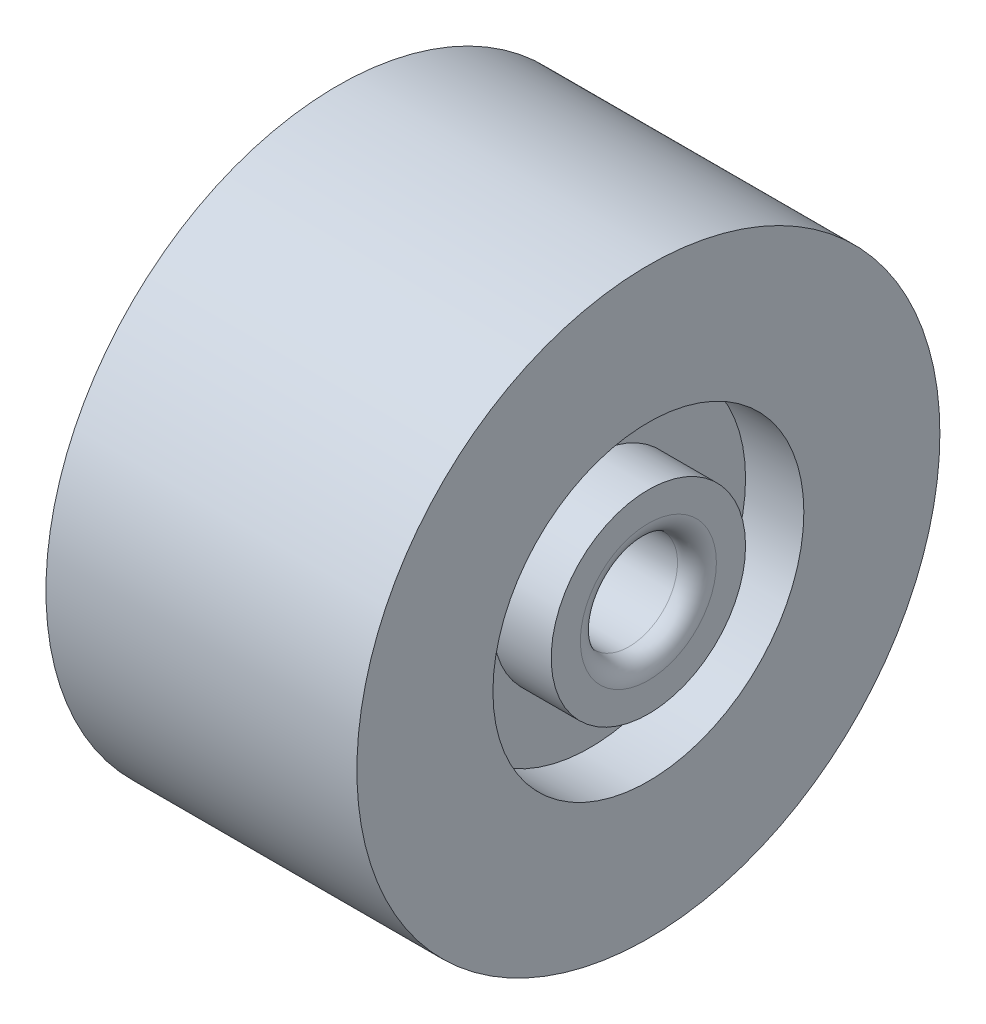
ISO-10303-21;
HEADER;
FILE_DESCRIPTION(('STEP AP214'),'2;1');
FILE_NAME('part.step','',(''),(''),'','','');
FILE_SCHEMA(('AUTOMOTIVE_DESIGN { 1 0 10303 214 1 1 1 1 }'));
ENDSEC;
DATA;
#1=APPLICATION_CONTEXT('core data for automotive mechanical design processes');
#2=APPLICATION_PROTOCOL_DEFINITION('international standard','automotive_design',2000,#1);
#3=PRODUCT_CONTEXT('',#1,'mechanical');
#4=PRODUCT('Part','Part','',(#3));
#5=PRODUCT_RELATED_PRODUCT_CATEGORY('part','',(#4));
#6=PRODUCT_DEFINITION_FORMATION('','',#4);
#7=PRODUCT_DEFINITION_CONTEXT('part definition',#1,'design');
#8=PRODUCT_DEFINITION('design','',#6,#7);
#9=PRODUCT_DEFINITION_SHAPE('','',#8);
#10=(LENGTH_UNIT() NAMED_UNIT(*) SI_UNIT(.MILLI.,.METRE.));
#11=(NAMED_UNIT(*) PLANE_ANGLE_UNIT() SI_UNIT($,.RADIAN.));
#12=(NAMED_UNIT(*) SI_UNIT($,.STERADIAN.) SOLID_ANGLE_UNIT());
#13=UNCERTAINTY_MEASURE_WITH_UNIT(LENGTH_MEASURE(1.E-05),#10,'distance_accuracy_value','');
#14=(GEOMETRIC_REPRESENTATION_CONTEXT(3) GLOBAL_UNCERTAINTY_ASSIGNED_CONTEXT((#13)) GLOBAL_UNIT_ASSIGNED_CONTEXT((#10,
#11,#12)) REPRESENTATION_CONTEXT('',''));
#15=CARTESIAN_POINT('',(0.,0.,0.));
#16=DIRECTION('',(0.,0.,1.));
#17=DIRECTION('',(1.,0.,0.));
#18=AXIS2_PLACEMENT_3D('',#15,#16,#17);
#19=CARTESIAN_POINT('',(0.,-2.50000000000001,0.));
#20=DIRECTION('',(1.,0.,0.));
#21=DIRECTION('',(0.,0.,-1.));
#22=AXIS2_PLACEMENT_3D('',#19,#20,#21);
#23=PLANE('',#22);
#24=CARTESIAN_POINT('',(0.,-2.50000000000001,0.));
#25=DIRECTION('',(1.,0.,0.));
#26=DIRECTION('',(0.,0.,-1.));
#27=AXIS2_PLACEMENT_3D('',#24,#25,#26);
#28=CIRCLE('',#27,3.5);
#29=CARTESIAN_POINT('',(0.,-2.50000000000001,-3.5));
#30=VERTEX_POINT('',#29);
#31=EDGE_CURVE('E10',#30,#30,#28,.F.);
#32=ORIENTED_EDGE('',*,*,#31,.T.);
#33=EDGE_LOOP('',(#32));
#34=FACE_BOUND('',#33,.T.);
#35=CARTESIAN_POINT('',(0.,-2.50000000000001,0.));
#36=DIRECTION('',(1.,0.,0.));
#37=DIRECTION('',(0.,0.,-1.));
#38=AXIS2_PLACEMENT_3D('',#35,#36,#37);
#39=CIRCLE('',#38,5.00000000000001);
#40=CARTESIAN_POINT('',(0.,-2.50000000000001,-5.00000000000001));
#41=VERTEX_POINT('',#40);
#42=EDGE_CURVE('E53',#41,#41,#39,.T.);
#43=ORIENTED_EDGE('',*,*,#42,.T.);
#44=EDGE_LOOP('',(#43));
#45=FACE_BOUND('',#44,.T.);
#46=ADVANCED_FACE('F33',(#34,#45),#23,.T.);
#47=CARTESIAN_POINT('',(8.18725966843203,-2.50000000000001,0.));
#48=DIRECTION('',(1.,0.,0.));
#49=DIRECTION('',(0.,0.,-1.));
#50=AXIS2_PLACEMENT_3D('',#47,#48,#49);
#51=CYLINDRICAL_SURFACE('',#50,5.00000000000001);
#52=CARTESIAN_POINT('',(-3.,-2.50000000000001,0.));
#53=DIRECTION('',(1.,0.,0.));
#54=DIRECTION('',(0.,0.,-1.));
#55=AXIS2_PLACEMENT_3D('',#52,#53,#54);
#56=CIRCLE('',#55,5.00000000000001);
#57=CARTESIAN_POINT('',(-3.,-2.50000000000001,-5.00000000000001));
#58=VERTEX_POINT('',#57);
#59=EDGE_CURVE('E56',#58,#58,#56,.T.);
#60=ORIENTED_EDGE('',*,*,#59,.T.);
#61=EDGE_LOOP('',(#60));
#62=FACE_BOUND('',#61,.T.);
#63=ORIENTED_EDGE('',*,*,#42,.F.);
#64=EDGE_LOOP('',(#63));
#65=FACE_BOUND('',#64,.T.);
#66=ADVANCED_FACE('F101',(#62,#65),#51,.T.);
#67=CARTESIAN_POINT('',(-3.,2.5,0.));
#68=DIRECTION('',(1.,0.,0.));
#69=DIRECTION('',(0.,0.,-1.));
#70=AXIS2_PLACEMENT_3D('',#67,#68,#69);
#71=PLANE('',#70);
#72=CARTESIAN_POINT('',(-3.,-2.50000000000001,0.));
#73=DIRECTION('',(1.,0.,0.));
#74=DIRECTION('',(0.,0.,-1.));
#75=AXIS2_PLACEMENT_3D('',#72,#73,#74);
#76=CIRCLE('',#75,8.00000000000001);
#77=CARTESIAN_POINT('',(-3.,-2.50000000000001,-8.00000000000001));
#78=VERTEX_POINT('',#77);
#79=EDGE_CURVE('E59',#78,#78,#76,.T.);
#80=ORIENTED_EDGE('',*,*,#79,.T.);
#81=EDGE_LOOP('',(#80));
#82=FACE_BOUND('',#81,.T.);
#83=ORIENTED_EDGE('',*,*,#59,.F.);
#84=EDGE_LOOP('',(#83));
#85=FACE_BOUND('',#84,.T.);
#86=ADVANCED_FACE('F106',(#82,#85),#71,.T.);
#87=CARTESIAN_POINT('',(8.18725966843203,-2.50000000000001,0.));
#88=DIRECTION('',(1.,0.,0.));
#89=DIRECTION('',(0.,0.,-1.));
#90=AXIS2_PLACEMENT_3D('',#87,#88,#89);
#91=CYLINDRICAL_SURFACE('',#90,8.00000000000001);
#92=CARTESIAN_POINT('',(0.,-2.50000000000001,0.));
#93=DIRECTION('',(1.,0.,0.));
#94=DIRECTION('',(0.,0.,-1.));
#95=AXIS2_PLACEMENT_3D('',#92,#93,#94);
#96=CIRCLE('',#95,8.00000000000001);
#97=CARTESIAN_POINT('',(0.,-2.50000000000001,-8.00000000000001));
#98=VERTEX_POINT('',#97);
#99=EDGE_CURVE('E62',#98,#98,#96,.T.);
#100=ORIENTED_EDGE('',*,*,#99,.T.);
#101=EDGE_LOOP('',(#100));
#102=FACE_BOUND('',#101,.T.);
#103=ORIENTED_EDGE('',*,*,#79,.F.);
#104=EDGE_LOOP('',(#103));
#105=FACE_BOUND('',#104,.T.);
#106=ADVANCED_FACE('F198',(#102,#105),#91,.F.);
#107=CARTESIAN_POINT('',(0.,5.5,0.));
#108=DIRECTION('',(1.,0.,0.));
#109=DIRECTION('',(0.,0.,-1.));
#110=AXIS2_PLACEMENT_3D('',#107,#108,#109);
#111=PLANE('',#110);
#112=CARTESIAN_POINT('',(0.,-2.50000000000001,0.));
#113=DIRECTION('',(1.,0.,0.));
#114=DIRECTION('',(0.,0.,-1.));
#115=AXIS2_PLACEMENT_3D('',#112,#113,#114);
#116=CIRCLE('',#115,15.);
#117=CARTESIAN_POINT('',(0.,-2.50000000000001,-15.));
#118=VERTEX_POINT('',#117);
#119=EDGE_CURVE('E65',#118,#118,#116,.T.);
#120=ORIENTED_EDGE('',*,*,#119,.T.);
#121=EDGE_LOOP('',(#120));
#122=FACE_BOUND('',#121,.T.);
#123=ORIENTED_EDGE('',*,*,#99,.F.);
#124=EDGE_LOOP('',(#123));
#125=FACE_BOUND('',#124,.T.);
#126=ADVANCED_FACE('F188',(#122,#125),#111,.T.);
#127=CARTESIAN_POINT('',(8.18725966843203,-2.50000000000001,0.));
#128=DIRECTION('',(1.,0.,0.));
#129=DIRECTION('',(0.,0.,-1.));
#130=AXIS2_PLACEMENT_3D('',#127,#128,#129);
#131=CYLINDRICAL_SURFACE('',#130,15.);
#132=CARTESIAN_POINT('',(-16.,-2.50000000000001,0.));
#133=DIRECTION('',(1.,0.,0.));
#134=DIRECTION('',(0.,0.,-1.));
#135=AXIS2_PLACEMENT_3D('',#132,#133,#134);
#136=CIRCLE('',#135,15.);
#137=CARTESIAN_POINT('',(-16.,-2.50000000000001,-15.));
#138=VERTEX_POINT('',#137);
#139=EDGE_CURVE('E68',#138,#138,#136,.T.);
#140=ORIENTED_EDGE('',*,*,#139,.T.);
#141=EDGE_LOOP('',(#140));
#142=FACE_BOUND('',#141,.T.);
#143=ORIENTED_EDGE('',*,*,#119,.F.);
#144=EDGE_LOOP('',(#143));
#145=FACE_BOUND('',#144,.T.);
#146=ADVANCED_FACE('F178',(#142,#145),#131,.T.);
#147=CARTESIAN_POINT('',(-16.,12.5,0.));
#148=DIRECTION('',(-1.,0.,0.));
#149=DIRECTION('',(0.,0.,1.));
#150=AXIS2_PLACEMENT_3D('',#147,#148,#149);
#151=PLANE('',#150);
#152=CARTESIAN_POINT('',(-16.,-2.50000000000001,0.));
#153=DIRECTION('',(1.,0.,0.));
#154=DIRECTION('',(0.,0.,-1.));
#155=AXIS2_PLACEMENT_3D('',#152,#153,#154);
#156=CIRCLE('',#155,8.00000000000001);
#157=CARTESIAN_POINT('',(-16.,-2.50000000000001,-8.00000000000001));
#158=VERTEX_POINT('',#157);
#159=EDGE_CURVE('E71',#158,#158,#156,.T.);
#160=ORIENTED_EDGE('',*,*,#159,.T.);
#161=EDGE_LOOP('',(#160));
#162=FACE_BOUND('',#161,.T.);
#163=ORIENTED_EDGE('',*,*,#139,.F.);
#164=EDGE_LOOP('',(#163));
#165=FACE_BOUND('',#164,.T.);
#166=ADVANCED_FACE('F168',(#162,#165),#151,.T.);
#167=CARTESIAN_POINT('',(8.18725966843203,-2.50000000000001,0.));
#168=DIRECTION('',(1.,0.,0.));
#169=DIRECTION('',(0.,0.,-1.));
#170=AXIS2_PLACEMENT_3D('',#167,#168,#169);
#171=CYLINDRICAL_SURFACE('',#170,8.00000000000001);
#172=CARTESIAN_POINT('',(-13.,-2.50000000000001,0.));
#173=DIRECTION('',(1.,0.,0.));
#174=DIRECTION('',(0.,0.,-1.));
#175=AXIS2_PLACEMENT_3D('',#172,#173,#174);
#176=CIRCLE('',#175,8.00000000000001);
#177=CARTESIAN_POINT('',(-13.,-2.50000000000001,-8.00000000000001));
#178=VERTEX_POINT('',#177);
#179=EDGE_CURVE('E74',#178,#178,#176,.T.);
#180=ORIENTED_EDGE('',*,*,#179,.T.);
#181=EDGE_LOOP('',(#180));
#182=FACE_BOUND('',#181,.T.);
#183=ORIENTED_EDGE('',*,*,#159,.F.);
#184=EDGE_LOOP('',(#183));
#185=FACE_BOUND('',#184,.T.);
#186=ADVANCED_FACE('F158',(#182,#185),#171,.F.);
#187=CARTESIAN_POINT('',(-13.,5.5,0.));
#188=DIRECTION('',(-1.,0.,0.));
#189=DIRECTION('',(0.,0.,1.));
#190=AXIS2_PLACEMENT_3D('',#187,#188,#189);
#191=PLANE('',#190);
#192=CARTESIAN_POINT('',(-13.,-2.50000000000001,0.));
#193=DIRECTION('',(1.,0.,0.));
#194=DIRECTION('',(0.,0.,-1.));
#195=AXIS2_PLACEMENT_3D('',#192,#193,#194);
#196=CIRCLE('',#195,5.00000000000001);
#197=CARTESIAN_POINT('',(-13.,-2.50000000000001,-5.00000000000001));
#198=VERTEX_POINT('',#197);
#199=EDGE_CURVE('E77',#198,#198,#196,.T.);
#200=ORIENTED_EDGE('',*,*,#199,.T.);
#201=EDGE_LOOP('',(#200));
#202=FACE_BOUND('',#201,.T.);
#203=ORIENTED_EDGE('',*,*,#179,.F.);
#204=EDGE_LOOP('',(#203));
#205=FACE_BOUND('',#204,.T.);
#206=ADVANCED_FACE('F98',(#202,#205),#191,.T.);
#207=CARTESIAN_POINT('',(8.18725966843203,-2.50000000000001,0.));
#208=DIRECTION('',(1.,0.,0.));
#209=DIRECTION('',(0.,0.,-1.));
#210=AXIS2_PLACEMENT_3D('',#207,#208,#209);
#211=CYLINDRICAL_SURFACE('',#210,5.00000000000001);
#212=CARTESIAN_POINT('',(-16.,-2.50000000000001,0.));
#213=DIRECTION('',(1.,0.,0.));
#214=DIRECTION('',(0.,0.,-1.));
#215=AXIS2_PLACEMENT_3D('',#212,#213,#214);
#216=CIRCLE('',#215,5.);
#217=CARTESIAN_POINT('',(-16.,-2.50000000000001,-5.));
#218=VERTEX_POINT('',#217);
#219=EDGE_CURVE('E80',#218,#218,#216,.T.);
#220=ORIENTED_EDGE('',*,*,#219,.T.);
#221=EDGE_LOOP('',(#220));
#222=FACE_BOUND('',#221,.T.);
#223=ORIENTED_EDGE('',*,*,#199,.F.);
#224=EDGE_LOOP('',(#223));
#225=FACE_BOUND('',#224,.T.);
#226=ADVANCED_FACE('F84',(#222,#225),#211,.T.);
#227=CARTESIAN_POINT('',(-16.,2.5,0.));
#228=DIRECTION('',(-1.,0.,0.));
#229=DIRECTION('',(0.,0.,1.));
#230=AXIS2_PLACEMENT_3D('',#227,#228,#229);
#231=PLANE('',#230);
#232=CARTESIAN_POINT('',(-16.,-2.50000000000001,0.));
#233=DIRECTION('',(-1.,0.,0.));
#234=DIRECTION('',(0.,0.,1.));
#235=AXIS2_PLACEMENT_3D('',#232,#233,#234);
#236=CIRCLE('',#235,3.5);
#237=CARTESIAN_POINT('',(-16.,-2.50000000000001,3.5));
#238=VERTEX_POINT('',#237);
#239=EDGE_CURVE('E40',#238,#238,#236,.F.);
#240=ORIENTED_EDGE('',*,*,#239,.T.);
#241=EDGE_LOOP('',(#240));
#242=FACE_BOUND('',#241,.T.);
#243=ORIENTED_EDGE('',*,*,#219,.F.);
#244=EDGE_LOOP('',(#243));
#245=FACE_BOUND('',#244,.T.);
#246=ADVANCED_FACE('F87',(#242,#245),#231,.T.);
#247=CARTESIAN_POINT('',(7.07106781186548,-2.50000000000001,0.));
#248=DIRECTION('',(-1.,0.,0.));
#249=DIRECTION('',(0.,0.,1.));
#250=AXIS2_PLACEMENT_3D('',#247,#248,#249);
#251=CYLINDRICAL_SURFACE('',#250,2.5);
#252=CARTESIAN_POINT('',(-15.,-2.50000000000001,0.));
#253=DIRECTION('',(-1.,0.,0.));
#254=DIRECTION('',(0.,0.,1.));
#255=AXIS2_PLACEMENT_3D('',#252,#253,#254);
#256=CIRCLE('',#255,2.5);
#257=CARTESIAN_POINT('',(-15.,-2.50000000000001,2.5));
#258=VERTEX_POINT('',#257);
#259=EDGE_CURVE('E44',#258,#258,#256,.T.);
#260=ORIENTED_EDGE('',*,*,#259,.T.);
#261=EDGE_LOOP('',(#260));
#262=FACE_BOUND('',#261,.T.);
#263=CARTESIAN_POINT('',(-1.,-2.50000000000001,0.));
#264=DIRECTION('',(1.,0.,0.));
#265=DIRECTION('',(0.,0.,-1.));
#266=AXIS2_PLACEMENT_3D('',#263,#264,#265);
#267=CIRCLE('',#266,2.5);
#268=CARTESIAN_POINT('',(-1.,-2.50000000000001,-2.5));
#269=VERTEX_POINT('',#268);
#270=EDGE_CURVE('E48',#269,#269,#267,.T.);
#271=ORIENTED_EDGE('',*,*,#270,.T.);
#272=EDGE_LOOP('',(#271));
#273=FACE_BOUND('',#272,.T.);
#274=ADVANCED_FACE('F89',(#262,#273),#251,.F.);
#275=CARTESIAN_POINT('',(-15.,-2.50000000000001,0.));
#276=DIRECTION('',(-1.,0.,0.));
#277=DIRECTION('',(0.,0.,1.));
#278=AXIS2_PLACEMENT_3D('',#275,#276,#277);
#279=TOROIDAL_SURFACE('',#278,3.5,1.);
#280=ORIENTED_EDGE('',*,*,#239,.F.);
#281=EDGE_LOOP('',(#280));
#282=FACE_BOUND('',#281,.T.);
#283=ORIENTED_EDGE('',*,*,#259,.F.);
#284=EDGE_LOOP('',(#283));
#285=FACE_BOUND('',#284,.T.);
#286=ADVANCED_FACE('F95',(#282,#285),#279,.T.);
#287=CARTESIAN_POINT('',(-1.,-2.50000000000001,0.));
#288=DIRECTION('',(1.,0.,0.));
#289=DIRECTION('',(0.,0.,-1.));
#290=AXIS2_PLACEMENT_3D('',#287,#288,#289);
#291=TOROIDAL_SURFACE('',#290,3.5,1.);
#292=ORIENTED_EDGE('',*,*,#270,.F.);
#293=EDGE_LOOP('',(#292));
#294=FACE_BOUND('',#293,.T.);
#295=ORIENTED_EDGE('',*,*,#31,.F.);
#296=EDGE_LOOP('',(#295));
#297=FACE_BOUND('',#296,.T.);
#298=ADVANCED_FACE('F35',(#294,#297),#291,.T.);
#299=CLOSED_SHELL('',(#46,#66,#86,#106,#126,#146,#166,#186,#206,#226,#246,#274,#286,#298));
#300=MANIFOLD_SOLID_BREP('B2',#299);
#301=ADVANCED_BREP_SHAPE_REPRESENTATION('',(#18,#300),#14);
#302=SHAPE_DEFINITION_REPRESENTATION(#9,#301);
ENDSEC;
END-ISO-10303-21;
